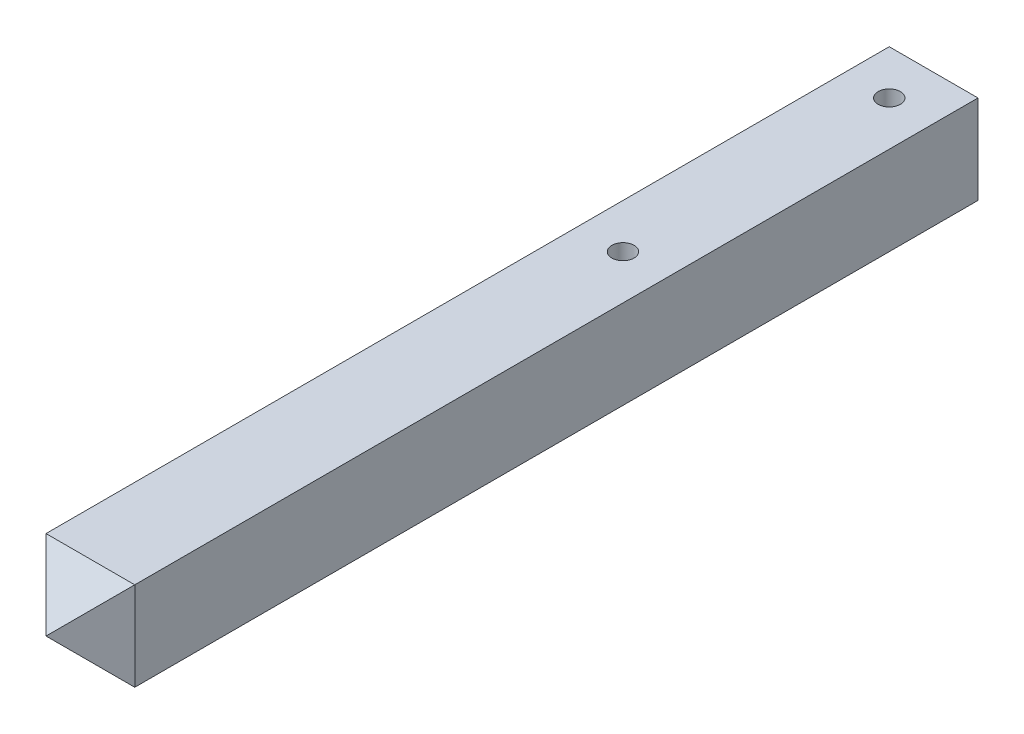
ISO-10303-21;
HEADER;
FILE_DESCRIPTION(('STEP AP214'),'2;1');
FILE_NAME('part.step','',(''),(''),'','','');
FILE_SCHEMA(('AUTOMOTIVE_DESIGN { 1 0 10303 214 1 1 1 1 }'));
ENDSEC;
DATA;
#1=APPLICATION_CONTEXT('core data for automotive mechanical design processes');
#2=APPLICATION_PROTOCOL_DEFINITION('international standard','automotive_design',2000,#1);
#3=PRODUCT_CONTEXT('',#1,'mechanical');
#4=PRODUCT('Part','Part','',(#3));
#5=PRODUCT_RELATED_PRODUCT_CATEGORY('part','',(#4));
#6=PRODUCT_DEFINITION_FORMATION('','',#4);
#7=PRODUCT_DEFINITION_CONTEXT('part definition',#1,'design');
#8=PRODUCT_DEFINITION('design','',#6,#7);
#9=PRODUCT_DEFINITION_SHAPE('','',#8);
#10=(LENGTH_UNIT() NAMED_UNIT(*) SI_UNIT(.MILLI.,.METRE.));
#11=(NAMED_UNIT(*) PLANE_ANGLE_UNIT() SI_UNIT($,.RADIAN.));
#12=(NAMED_UNIT(*) SI_UNIT($,.STERADIAN.) SOLID_ANGLE_UNIT());
#13=UNCERTAINTY_MEASURE_WITH_UNIT(LENGTH_MEASURE(1.E-05),#10,'distance_accuracy_value','');
#14=(GEOMETRIC_REPRESENTATION_CONTEXT(3) GLOBAL_UNCERTAINTY_ASSIGNED_CONTEXT((#13)) GLOBAL_UNIT_ASSIGNED_CONTEXT((#10,
#11,#12)) REPRESENTATION_CONTEXT('',''));
#15=CARTESIAN_POINT('',(0.,0.,0.));
#16=DIRECTION('',(0.,0.,1.));
#17=DIRECTION('',(1.,0.,0.));
#18=AXIS2_PLACEMENT_3D('',#15,#16,#17);
#19=CARTESIAN_POINT('',(0.,20.,0.));
#20=DIRECTION('',(0.,1.,0.));
#21=DIRECTION('',(0.,0.,1.));
#22=AXIS2_PLACEMENT_3D('',#19,#20,#21);
#23=PLANE('',#22);
#24=CARTESIAN_POINT('',(10.,20.,10.));
#25=DIRECTION('',(0.,1.,0.));
#26=DIRECTION('',(0.,0.,1.));
#27=AXIS2_PLACEMENT_3D('',#24,#25,#26);
#28=CIRCLE('',#27,2.5);
#29=CARTESIAN_POINT('',(10.,20.,12.5));
#30=VERTEX_POINT('',#29);
#31=EDGE_CURVE('E104',#30,#30,#28,.T.);
#32=ORIENTED_EDGE('',*,*,#31,.F.);
#33=EDGE_LOOP('',(#32));
#34=FACE_BOUND('',#33,.T.);
#35=DIRECTION('',(0.,0.,1.));
#36=VECTOR('',#35,1.);
#37=CARTESIAN_POINT('',(0.,20.,0.));
#38=LINE('',#37,#36);
#39=CARTESIAN_POINT('',(0.,20.,0.));
#40=VERTEX_POINT('',#39);
#41=CARTESIAN_POINT('',(0.,20.,190.));
#42=VERTEX_POINT('',#41);
#43=EDGE_CURVE('E84',#40,#42,#38,.T.);
#44=ORIENTED_EDGE('',*,*,#43,.T.);
#45=DIRECTION('',(1.,0.,0.));
#46=VECTOR('',#45,1.);
#47=CARTESIAN_POINT('',(20.,20.,190.));
#48=LINE('',#47,#46);
#49=CARTESIAN_POINT('',(20.,20.,190.));
#50=VERTEX_POINT('',#49);
#51=EDGE_CURVE('E11',#42,#50,#48,.T.);
#52=ORIENTED_EDGE('',*,*,#51,.T.);
#53=DIRECTION('',(0.,0.,-1.));
#54=VECTOR('',#53,1.);
#55=CARTESIAN_POINT('',(20.,20.,0.));
#56=LINE('',#55,#54);
#57=CARTESIAN_POINT('',(20.,20.,0.));
#58=VERTEX_POINT('',#57);
#59=EDGE_CURVE('E74',#50,#58,#56,.T.);
#60=ORIENTED_EDGE('',*,*,#59,.T.);
#61=DIRECTION('',(-1.,0.,0.));
#62=VECTOR('',#61,1.);
#63=CARTESIAN_POINT('',(0.,20.,0.));
#64=LINE('',#63,#62);
#65=EDGE_CURVE('E78',#58,#40,#64,.T.);
#66=ORIENTED_EDGE('',*,*,#65,.T.);
#67=EDGE_LOOP('',(#44,#52,#60,#66));
#68=FACE_BOUND('',#67,.T.);
#69=CARTESIAN_POINT('',(10.,20.,70.));
#70=DIRECTION('',(0.,1.,0.));
#71=DIRECTION('',(0.,0.,1.));
#72=AXIS2_PLACEMENT_3D('',#69,#70,#71);
#73=CIRCLE('',#72,2.5);
#74=CARTESIAN_POINT('',(10.,20.,72.5));
#75=VERTEX_POINT('',#74);
#76=EDGE_CURVE('E127',#75,#75,#73,.T.);
#77=ORIENTED_EDGE('',*,*,#76,.F.);
#78=EDGE_LOOP('',(#77));
#79=FACE_BOUND('',#78,.T.);
#80=ADVANCED_FACE('F34',(#34,#68,#79),#23,.T.);
#81=CARTESIAN_POINT('',(0.,0.,0.));
#82=DIRECTION('',(0.,1.,0.));
#83=DIRECTION('',(0.,0.,1.));
#84=AXIS2_PLACEMENT_3D('',#81,#82,#83);
#85=PLANE('',#84);
#86=CARTESIAN_POINT('',(10.,0.,10.));
#87=DIRECTION('',(0.,1.,0.));
#88=DIRECTION('',(0.,0.,1.));
#89=AXIS2_PLACEMENT_3D('',#86,#87,#88);
#90=CIRCLE('',#89,2.5);
#91=CARTESIAN_POINT('',(10.,0.,12.5));
#92=VERTEX_POINT('',#91);
#93=EDGE_CURVE('E132',#92,#92,#90,.T.);
#94=ORIENTED_EDGE('',*,*,#93,.T.);
#95=EDGE_LOOP('',(#94));
#96=FACE_BOUND('',#95,.T.);
#97=DIRECTION('',(0.,0.,-1.));
#98=VECTOR('',#97,1.);
#99=CARTESIAN_POINT('',(20.,0.,0.));
#100=LINE('',#99,#98);
#101=CARTESIAN_POINT('',(20.,0.,190.));
#102=VERTEX_POINT('',#101);
#103=CARTESIAN_POINT('',(20.,0.,0.));
#104=VERTEX_POINT('',#103);
#105=EDGE_CURVE('E90',#102,#104,#100,.T.);
#106=ORIENTED_EDGE('',*,*,#105,.F.);
#107=DIRECTION('',(-1.,0.,0.));
#108=VECTOR('',#107,1.);
#109=CARTESIAN_POINT('',(0.,0.,190.));
#110=LINE('',#109,#108);
#111=CARTESIAN_POINT('',(0.,0.,190.));
#112=VERTEX_POINT('',#111);
#113=EDGE_CURVE('E109',#102,#112,#110,.T.);
#114=ORIENTED_EDGE('',*,*,#113,.T.);
#115=DIRECTION('',(0.,0.,1.));
#116=VECTOR('',#115,1.);
#117=CARTESIAN_POINT('',(0.,0.,0.));
#118=LINE('',#117,#116);
#119=CARTESIAN_POINT('',(0.,0.,0.));
#120=VERTEX_POINT('',#119);
#121=EDGE_CURVE('E102',#120,#112,#118,.T.);
#122=ORIENTED_EDGE('',*,*,#121,.F.);
#123=DIRECTION('',(-1.,0.,0.));
#124=VECTOR('',#123,1.);
#125=CARTESIAN_POINT('',(0.,0.,0.));
#126=LINE('',#125,#124);
#127=EDGE_CURVE('E106',#104,#120,#126,.T.);
#128=ORIENTED_EDGE('',*,*,#127,.F.);
#129=EDGE_LOOP('',(#106,#114,#122,#128));
#130=FACE_BOUND('',#129,.T.);
#131=CARTESIAN_POINT('',(10.,0.,70.));
#132=DIRECTION('',(0.,1.,0.));
#133=DIRECTION('',(0.,0.,1.));
#134=AXIS2_PLACEMENT_3D('',#131,#132,#133);
#135=CIRCLE('',#134,2.5);
#136=CARTESIAN_POINT('',(10.,0.,72.5));
#137=VERTEX_POINT('',#136);
#138=EDGE_CURVE('E123',#137,#137,#135,.T.);
#139=ORIENTED_EDGE('',*,*,#138,.T.);
#140=EDGE_LOOP('',(#139));
#141=FACE_BOUND('',#140,.T.);
#142=ADVANCED_FACE('F144',(#96,#130,#141),#85,.F.);
#143=CARTESIAN_POINT('',(0.,20.,0.));
#144=DIRECTION('',(1.,0.,0.));
#145=DIRECTION('',(0.,0.,-1.));
#146=AXIS2_PLACEMENT_3D('',#143,#144,#145);
#147=PLANE('',#146);
#148=ORIENTED_EDGE('',*,*,#121,.T.);
#149=DIRECTION('',(0.,1.,0.));
#150=VECTOR('',#149,1.);
#151=CARTESIAN_POINT('',(0.,20.,190.));
#152=LINE('',#151,#150);
#153=EDGE_CURVE('E44',#112,#42,#152,.T.);
#154=ORIENTED_EDGE('',*,*,#153,.T.);
#155=ORIENTED_EDGE('',*,*,#43,.F.);
#156=DIRECTION('',(0.,-1.,0.));
#157=VECTOR('',#156,1.);
#158=CARTESIAN_POINT('',(0.,20.,0.));
#159=LINE('',#158,#157);
#160=EDGE_CURVE('E94',#40,#120,#159,.T.);
#161=ORIENTED_EDGE('',*,*,#160,.T.);
#162=EDGE_LOOP('',(#148,#154,#155,#161));
#163=FACE_BOUND('',#162,.T.);
#164=ADVANCED_FACE('F146',(#163),#147,.F.);
#165=CARTESIAN_POINT('',(20.,20.,0.));
#166=DIRECTION('',(-1.,0.,0.));
#167=DIRECTION('',(0.,0.,1.));
#168=AXIS2_PLACEMENT_3D('',#165,#166,#167);
#169=PLANE('',#168);
#170=ORIENTED_EDGE('',*,*,#59,.F.);
#171=DIRECTION('',(0.,-1.,0.));
#172=VECTOR('',#171,1.);
#173=CARTESIAN_POINT('',(20.,20.,190.));
#174=LINE('',#173,#172);
#175=EDGE_CURVE('E93',#50,#102,#174,.T.);
#176=ORIENTED_EDGE('',*,*,#175,.T.);
#177=ORIENTED_EDGE('',*,*,#105,.T.);
#178=DIRECTION('',(0.,-1.,0.));
#179=VECTOR('',#178,1.);
#180=CARTESIAN_POINT('',(20.,20.,0.));
#181=LINE('',#180,#179);
#182=EDGE_CURVE('E87',#58,#104,#181,.T.);
#183=ORIENTED_EDGE('',*,*,#182,.F.);
#184=EDGE_LOOP('',(#170,#176,#177,#183));
#185=FACE_BOUND('',#184,.T.);
#186=ADVANCED_FACE('F88',(#185),#169,.F.);
#187=CARTESIAN_POINT('',(0.,20.,0.));
#188=DIRECTION('',(0.,0.,1.));
#189=DIRECTION('',(1.,0.,0.));
#190=AXIS2_PLACEMENT_3D('',#187,#188,#189);
#191=PLANE('',#190);
#192=ORIENTED_EDGE('',*,*,#127,.T.);
#193=ORIENTED_EDGE('',*,*,#160,.F.);
#194=ORIENTED_EDGE('',*,*,#65,.F.);
#195=ORIENTED_EDGE('',*,*,#182,.T.);
#196=EDGE_LOOP('',(#192,#193,#194,#195));
#197=FACE_BOUND('',#196,.T.);
#198=ADVANCED_FACE('F96',(#197),#191,.F.);
#199=CARTESIAN_POINT('',(10.,20.,10.));
#200=DIRECTION('',(0.,-1.,0.));
#201=DIRECTION('',(0.,0.,-1.));
#202=AXIS2_PLACEMENT_3D('',#199,#200,#201);
#203=CYLINDRICAL_SURFACE('',#202,2.5);
#204=ORIENTED_EDGE('',*,*,#31,.T.);
#205=EDGE_LOOP('',(#204));
#206=FACE_BOUND('',#205,.T.);
#207=ORIENTED_EDGE('',*,*,#93,.F.);
#208=EDGE_LOOP('',(#207));
#209=FACE_BOUND('',#208,.T.);
#210=ADVANCED_FACE('F164',(#206,#209),#203,.F.);
#211=CARTESIAN_POINT('',(10.,20.,70.));
#212=DIRECTION('',(0.,-1.,0.));
#213=DIRECTION('',(0.,0.,-1.));
#214=AXIS2_PLACEMENT_3D('',#211,#212,#213);
#215=CYLINDRICAL_SURFACE('',#214,2.5);
#216=ORIENTED_EDGE('',*,*,#76,.T.);
#217=EDGE_LOOP('',(#216));
#218=FACE_BOUND('',#217,.T.);
#219=ORIENTED_EDGE('',*,*,#138,.F.);
#220=EDGE_LOOP('',(#219));
#221=FACE_BOUND('',#220,.T.);
#222=ADVANCED_FACE('F171',(#218,#221),#215,.F.);
#223=CARTESIAN_POINT('',(10.,20.,200.));
#224=DIRECTION('',(0.707106781186546,0.,-0.707106781186548));
#225=DIRECTION('',(0.,-1.,0.));
#226=AXIS2_PLACEMENT_3D('',#223,#224,#225);
#227=PLANE('',#226);
#228=DIRECTION('',(-0.577350269189626,0.577350269189626,-0.577350269189625));
#229=VECTOR('',#228,1.);
#230=CARTESIAN_POINT('',(0.,20.,190.));
#231=LINE('',#230,#229);
#232=CARTESIAN_POINT('',(10.,10.,200.));
#233=VERTEX_POINT('',#232);
#234=EDGE_CURVE('E38',#42,#233,#231,.F.);
#235=ORIENTED_EDGE('',*,*,#234,.F.);
#236=ORIENTED_EDGE('',*,*,#153,.F.);
#237=DIRECTION('',(0.577350269189626,0.577350269189626,0.577350269189625));
#238=VECTOR('',#237,1.);
#239=CARTESIAN_POINT('',(13.3333333333334,13.3333333333333,203.333333333333));
#240=LINE('',#239,#238);
#241=EDGE_CURVE('E116',#233,#112,#240,.F.);
#242=ORIENTED_EDGE('',*,*,#241,.F.);
#243=EDGE_LOOP('',(#235,#236,#242));
#244=FACE_BOUND('',#243,.T.);
#245=ADVANCED_FACE('F36',(#244),#227,.F.);
#246=CARTESIAN_POINT('',(0.,20.,190.));
#247=DIRECTION('',(0.,0.707106781186546,0.707106781186548));
#248=DIRECTION('',(-1.,0.,0.));
#249=AXIS2_PLACEMENT_3D('',#246,#247,#248);
#250=PLANE('',#249);
#251=ORIENTED_EDGE('',*,*,#51,.F.);
#252=ORIENTED_EDGE('',*,*,#234,.T.);
#253=DIRECTION('',(-0.577350269189626,-0.577350269189626,0.577350269189625));
#254=VECTOR('',#253,1.);
#255=CARTESIAN_POINT('',(13.3333333333333,13.3333333333333,196.666666666667));
#256=LINE('',#255,#254);
#257=EDGE_CURVE('E114',#50,#233,#256,.T.);
#258=ORIENTED_EDGE('',*,*,#257,.F.);
#259=EDGE_LOOP('',(#251,#252,#258));
#260=FACE_BOUND('',#259,.T.);
#261=ADVANCED_FACE('F139',(#260),#250,.T.);
#262=CARTESIAN_POINT('',(0.,10.,200.));
#263=DIRECTION('',(0.,0.707106781186546,-0.707106781186548));
#264=DIRECTION('',(1.,0.,0.));
#265=AXIS2_PLACEMENT_3D('',#262,#263,#264);
#266=PLANE('',#265);
#267=ORIENTED_EDGE('',*,*,#241,.T.);
#268=ORIENTED_EDGE('',*,*,#113,.F.);
#269=DIRECTION('',(-0.577350269189626,0.577350269189626,0.577350269189625));
#270=VECTOR('',#269,1.);
#271=CARTESIAN_POINT('',(6.66666666666668,13.3333333333333,203.333333333333));
#272=LINE('',#271,#270);
#273=EDGE_CURVE('E112',#233,#102,#272,.F.);
#274=ORIENTED_EDGE('',*,*,#273,.F.);
#275=EDGE_LOOP('',(#267,#268,#274));
#276=FACE_BOUND('',#275,.T.);
#277=ADVANCED_FACE('F187',(#276),#266,.F.);
#278=CARTESIAN_POINT('',(20.,20.,190.));
#279=DIRECTION('',(-0.707106781186546,0.,-0.707106781186549));
#280=DIRECTION('',(0.,-1.,0.));
#281=AXIS2_PLACEMENT_3D('',#278,#279,#280);
#282=PLANE('',#281);
#283=ORIENTED_EDGE('',*,*,#175,.F.);
#284=ORIENTED_EDGE('',*,*,#257,.T.);
#285=ORIENTED_EDGE('',*,*,#273,.T.);
#286=EDGE_LOOP('',(#283,#284,#285));
#287=FACE_BOUND('',#286,.T.);
#288=ADVANCED_FACE('F142',(#287),#282,.F.);
#289=CLOSED_SHELL('',(#80,#142,#164,#186,#198,#210,#222,#245,#261,#277,#288));
#290=MANIFOLD_SOLID_BREP('B2',#289);
#291=ADVANCED_BREP_SHAPE_REPRESENTATION('',(#18,#290),#14);
#292=SHAPE_DEFINITION_REPRESENTATION(#9,#291);
ENDSEC;
END-ISO-10303-21;
